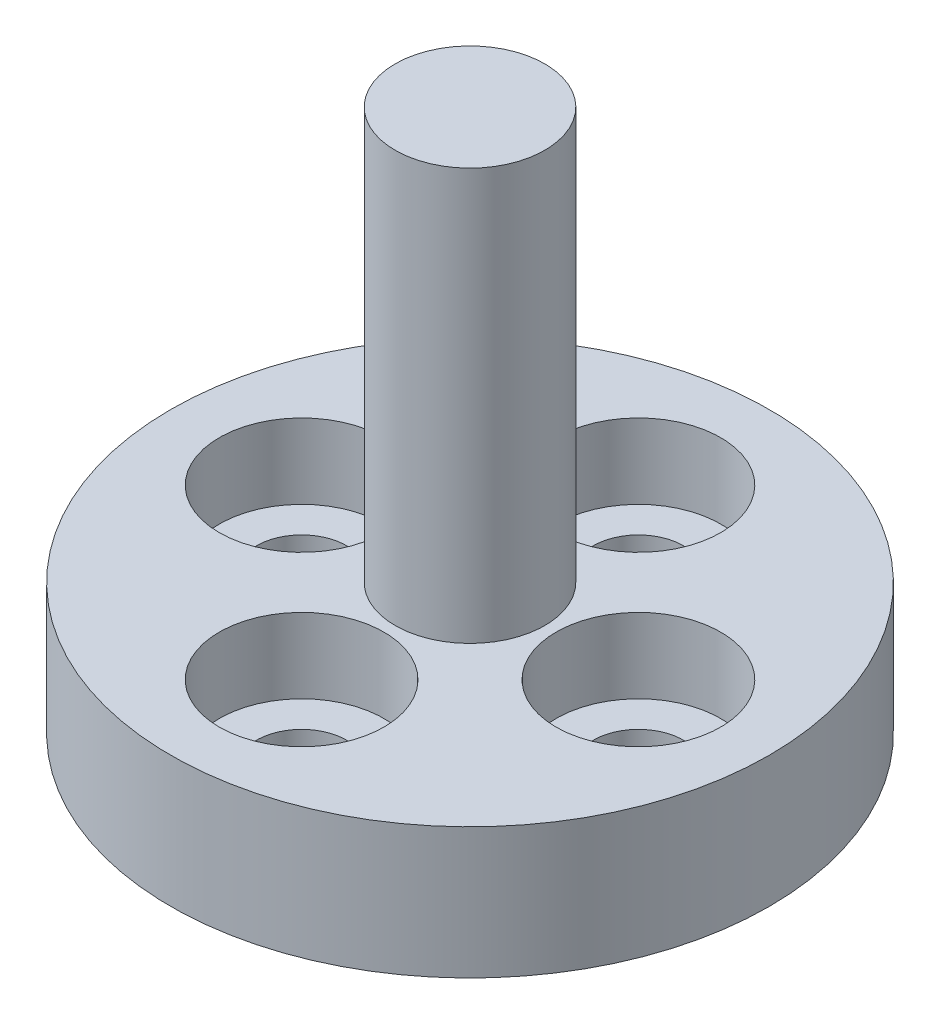
ISO-10303-21;
HEADER;
FILE_DESCRIPTION(('STEP AP214'),'2;1');
FILE_NAME('part.step','',(''),(''),'','','');
FILE_SCHEMA(('AUTOMOTIVE_DESIGN { 1 0 10303 214 1 1 1 1 }'));
ENDSEC;
DATA;
#1=APPLICATION_CONTEXT('core data for automotive mechanical design processes');
#2=APPLICATION_PROTOCOL_DEFINITION('international standard','automotive_design',2000,#1);
#3=PRODUCT_CONTEXT('',#1,'mechanical');
#4=PRODUCT('Part','Part','',(#3));
#5=PRODUCT_RELATED_PRODUCT_CATEGORY('part','',(#4));
#6=PRODUCT_DEFINITION_FORMATION('','',#4);
#7=PRODUCT_DEFINITION_CONTEXT('part definition',#1,'design');
#8=PRODUCT_DEFINITION('design','',#6,#7);
#9=PRODUCT_DEFINITION_SHAPE('','',#8);
#10=(LENGTH_UNIT() NAMED_UNIT(*) SI_UNIT(.MILLI.,.METRE.));
#11=(NAMED_UNIT(*) PLANE_ANGLE_UNIT() SI_UNIT($,.RADIAN.));
#12=(NAMED_UNIT(*) SI_UNIT($,.STERADIAN.) SOLID_ANGLE_UNIT());
#13=UNCERTAINTY_MEASURE_WITH_UNIT(LENGTH_MEASURE(1.E-05),#10,'distance_accuracy_value','');
#14=(GEOMETRIC_REPRESENTATION_CONTEXT(3) GLOBAL_UNCERTAINTY_ASSIGNED_CONTEXT((#13)) GLOBAL_UNIT_ASSIGNED_CONTEXT((#10,
#11,#12)) REPRESENTATION_CONTEXT('',''));
#15=CARTESIAN_POINT('',(0.,0.,0.));
#16=DIRECTION('',(0.,0.,1.));
#17=DIRECTION('',(1.,0.,0.));
#18=AXIS2_PLACEMENT_3D('',#15,#16,#17);
#19=CARTESIAN_POINT('',(0.,0.,0.));
#20=DIRECTION('',(0.,1.,0.));
#21=DIRECTION('',(-1.,0.,0.));
#22=AXIS2_PLACEMENT_3D('',#19,#20,#21);
#23=PLANE('',#22);
#24=CARTESIAN_POINT('',(-4.5,0.,0.));
#25=DIRECTION('',(0.,1.,0.));
#26=DIRECTION('',(0.,0.,1.));
#27=AXIS2_PLACEMENT_3D('',#24,#25,#26);
#28=CIRCLE('',#27,1.2);
#29=CARTESIAN_POINT('',(-4.5,0.,1.2));
#30=VERTEX_POINT('',#29);
#31=EDGE_CURVE('E85',#30,#30,#28,.T.);
#32=ORIENTED_EDGE('',*,*,#31,.T.);
#33=EDGE_LOOP('',(#32));
#34=FACE_BOUND('',#33,.T.);
#35=CARTESIAN_POINT('',(0.,0.,-4.5));
#36=DIRECTION('',(0.,1.,0.));
#37=DIRECTION('',(0.,0.,1.));
#38=AXIS2_PLACEMENT_3D('',#35,#36,#37);
#39=CIRCLE('',#38,1.2);
#40=CARTESIAN_POINT('',(0.,0.,-3.3));
#41=VERTEX_POINT('',#40);
#42=EDGE_CURVE('E73',#41,#41,#39,.T.);
#43=ORIENTED_EDGE('',*,*,#42,.T.);
#44=EDGE_LOOP('',(#43));
#45=FACE_BOUND('',#44,.T.);
#46=CARTESIAN_POINT('',(4.5,0.,0.));
#47=DIRECTION('',(0.,1.,0.));
#48=DIRECTION('',(0.,0.,1.));
#49=AXIS2_PLACEMENT_3D('',#46,#47,#48);
#50=CIRCLE('',#49,1.2);
#51=CARTESIAN_POINT('',(4.5,0.,1.2));
#52=VERTEX_POINT('',#51);
#53=EDGE_CURVE('E61',#52,#52,#50,.T.);
#54=ORIENTED_EDGE('',*,*,#53,.T.);
#55=EDGE_LOOP('',(#54));
#56=FACE_BOUND('',#55,.T.);
#57=CARTESIAN_POINT('',(0.,0.,4.5));
#58=DIRECTION('',(0.,1.,0.));
#59=DIRECTION('',(0.,0.,1.));
#60=AXIS2_PLACEMENT_3D('',#57,#58,#59);
#61=CIRCLE('',#60,1.2);
#62=CARTESIAN_POINT('',(0.,0.,5.7));
#63=VERTEX_POINT('',#62);
#64=EDGE_CURVE('E49',#63,#63,#61,.T.);
#65=ORIENTED_EDGE('',*,*,#64,.T.);
#66=EDGE_LOOP('',(#65));
#67=FACE_BOUND('',#66,.T.);
#68=CARTESIAN_POINT('',(0.,0.,0.));
#69=DIRECTION('',(0.,1.,0.));
#70=DIRECTION('',(-1.,0.,0.));
#71=AXIS2_PLACEMENT_3D('',#68,#69,#70);
#72=CIRCLE('',#71,8.);
#73=CARTESIAN_POINT('',(-8.,0.,0.));
#74=VERTEX_POINT('',#73);
#75=EDGE_CURVE('E10',#74,#74,#72,.T.);
#76=ORIENTED_EDGE('',*,*,#75,.F.);
#77=EDGE_LOOP('',(#76));
#78=FACE_BOUND('',#77,.T.);
#79=ADVANCED_FACE('F30',(#34,#45,#56,#67,#78),#23,.F.);
#80=CARTESIAN_POINT('',(0.,14.5,0.));
#81=DIRECTION('',(0.,1.,0.));
#82=DIRECTION('',(-1.,0.,0.));
#83=AXIS2_PLACEMENT_3D('',#80,#81,#82);
#84=CYLINDRICAL_SURFACE('',#83,8.);
#85=CARTESIAN_POINT('',(0.,3.5,0.));
#86=DIRECTION('',(0.,1.,0.));
#87=DIRECTION('',(-1.,0.,0.));
#88=AXIS2_PLACEMENT_3D('',#85,#86,#87);
#89=CIRCLE('',#88,8.);
#90=CARTESIAN_POINT('',(-8.,3.5,0.));
#91=VERTEX_POINT('',#90);
#92=EDGE_CURVE('E36',#91,#91,#89,.T.);
#93=ORIENTED_EDGE('',*,*,#92,.F.);
#94=EDGE_LOOP('',(#93));
#95=FACE_BOUND('',#94,.T.);
#96=ORIENTED_EDGE('',*,*,#75,.T.);
#97=EDGE_LOOP('',(#96));
#98=FACE_BOUND('',#97,.T.);
#99=ADVANCED_FACE('F104',(#95,#98),#84,.T.);
#100=CARTESIAN_POINT('',(8.,3.5,0.));
#101=DIRECTION('',(0.,-1.,0.));
#102=DIRECTION('',(1.,0.,0.));
#103=AXIS2_PLACEMENT_3D('',#100,#101,#102);
#104=PLANE('',#103);
#105=CARTESIAN_POINT('',(-4.5,3.5,0.));
#106=DIRECTION('',(0.,1.,0.));
#107=DIRECTION('',(0.,0.,1.));
#108=AXIS2_PLACEMENT_3D('',#105,#106,#107);
#109=CIRCLE('',#108,2.2);
#110=CARTESIAN_POINT('',(-4.5,3.5,2.2));
#111=VERTEX_POINT('',#110);
#112=EDGE_CURVE('E94',#111,#111,#109,.T.);
#113=ORIENTED_EDGE('',*,*,#112,.F.);
#114=EDGE_LOOP('',(#113));
#115=FACE_BOUND('',#114,.T.);
#116=CARTESIAN_POINT('',(0.,3.5,-4.5));
#117=DIRECTION('',(0.,1.,0.));
#118=DIRECTION('',(0.,0.,1.));
#119=AXIS2_PLACEMENT_3D('',#116,#117,#118);
#120=CIRCLE('',#119,2.2);
#121=CARTESIAN_POINT('',(0.,3.5,-2.3));
#122=VERTEX_POINT('',#121);
#123=EDGE_CURVE('E82',#122,#122,#120,.T.);
#124=ORIENTED_EDGE('',*,*,#123,.F.);
#125=EDGE_LOOP('',(#124));
#126=FACE_BOUND('',#125,.T.);
#127=CARTESIAN_POINT('',(4.5,3.5,0.));
#128=DIRECTION('',(0.,1.,0.));
#129=DIRECTION('',(0.,0.,1.));
#130=AXIS2_PLACEMENT_3D('',#127,#128,#129);
#131=CIRCLE('',#130,2.2);
#132=CARTESIAN_POINT('',(4.5,3.5,2.2));
#133=VERTEX_POINT('',#132);
#134=EDGE_CURVE('E70',#133,#133,#131,.T.);
#135=ORIENTED_EDGE('',*,*,#134,.F.);
#136=EDGE_LOOP('',(#135));
#137=FACE_BOUND('',#136,.T.);
#138=CARTESIAN_POINT('',(0.,3.5,4.5));
#139=DIRECTION('',(0.,1.,0.));
#140=DIRECTION('',(0.,0.,1.));
#141=AXIS2_PLACEMENT_3D('',#138,#139,#140);
#142=CIRCLE('',#141,2.2);
#143=CARTESIAN_POINT('',(0.,3.5,6.7));
#144=VERTEX_POINT('',#143);
#145=EDGE_CURVE('E58',#144,#144,#142,.T.);
#146=ORIENTED_EDGE('',*,*,#145,.F.);
#147=EDGE_LOOP('',(#146));
#148=FACE_BOUND('',#147,.T.);
#149=CARTESIAN_POINT('',(0.,3.5,0.));
#150=DIRECTION('',(0.,1.,0.));
#151=DIRECTION('',(-1.,0.,0.));
#152=AXIS2_PLACEMENT_3D('',#149,#150,#151);
#153=CIRCLE('',#152,2.);
#154=CARTESIAN_POINT('',(-2.,3.5,0.));
#155=VERTEX_POINT('',#154);
#156=EDGE_CURVE('E40',#155,#155,#153,.T.);
#157=ORIENTED_EDGE('',*,*,#156,.F.);
#158=EDGE_LOOP('',(#157));
#159=FACE_BOUND('',#158,.T.);
#160=ORIENTED_EDGE('',*,*,#92,.T.);
#161=EDGE_LOOP('',(#160));
#162=FACE_BOUND('',#161,.T.);
#163=ADVANCED_FACE('F100',(#115,#126,#137,#148,#159,#162),#104,.F.);
#164=CARTESIAN_POINT('',(0.,14.5,0.));
#165=DIRECTION('',(0.,1.,0.));
#166=DIRECTION('',(-1.,0.,0.));
#167=AXIS2_PLACEMENT_3D('',#164,#165,#166);
#168=CYLINDRICAL_SURFACE('',#167,2.);
#169=CARTESIAN_POINT('',(0.,14.5,0.));
#170=DIRECTION('',(0.,1.,0.));
#171=DIRECTION('',(-1.,0.,0.));
#172=AXIS2_PLACEMENT_3D('',#169,#170,#171);
#173=CIRCLE('',#172,2.);
#174=CARTESIAN_POINT('',(-2.,14.5,0.));
#175=VERTEX_POINT('',#174);
#176=EDGE_CURVE('E44',#175,#175,#173,.T.);
#177=ORIENTED_EDGE('',*,*,#176,.F.);
#178=EDGE_LOOP('',(#177));
#179=FACE_BOUND('',#178,.T.);
#180=ORIENTED_EDGE('',*,*,#156,.T.);
#181=EDGE_LOOP('',(#180));
#182=FACE_BOUND('',#181,.T.);
#183=ADVANCED_FACE('F103',(#179,#182),#168,.T.);
#184=CARTESIAN_POINT('',(2.,14.5,0.));
#185=DIRECTION('',(0.,-1.,0.));
#186=DIRECTION('',(1.,0.,0.));
#187=AXIS2_PLACEMENT_3D('',#184,#185,#186);
#188=PLANE('',#187);
#189=ORIENTED_EDGE('',*,*,#176,.T.);
#190=EDGE_LOOP('',(#189));
#191=FACE_BOUND('',#190,.T.);
#192=ADVANCED_FACE('F115',(#191),#188,.F.);
#193=CARTESIAN_POINT('',(0.,3.5,4.5));
#194=DIRECTION('',(0.,1.,0.));
#195=DIRECTION('',(0.,0.,1.));
#196=AXIS2_PLACEMENT_3D('',#193,#194,#195);
#197=CYLINDRICAL_SURFACE('',#196,1.2);
#198=ORIENTED_EDGE('',*,*,#64,.F.);
#199=EDGE_LOOP('',(#198));
#200=FACE_BOUND('',#199,.T.);
#201=CARTESIAN_POINT('',(0.,1.5,4.5));
#202=DIRECTION('',(0.,1.,0.));
#203=DIRECTION('',(0.,0.,1.));
#204=AXIS2_PLACEMENT_3D('',#201,#202,#203);
#205=CIRCLE('',#204,1.2);
#206=CARTESIAN_POINT('',(0.,1.5,5.7));
#207=VERTEX_POINT('',#206);
#208=EDGE_CURVE('E52',#207,#207,#205,.T.);
#209=ORIENTED_EDGE('',*,*,#208,.T.);
#210=EDGE_LOOP('',(#209));
#211=FACE_BOUND('',#210,.T.);
#212=ADVANCED_FACE('F121',(#200,#211),#197,.F.);
#213=CARTESIAN_POINT('',(1.2,1.5,4.5));
#214=DIRECTION('',(0.,-1.,0.));
#215=DIRECTION('',(0.,0.,-1.));
#216=AXIS2_PLACEMENT_3D('',#213,#214,#215);
#217=PLANE('',#216);
#218=ORIENTED_EDGE('',*,*,#208,.F.);
#219=EDGE_LOOP('',(#218));
#220=FACE_BOUND('',#219,.T.);
#221=CARTESIAN_POINT('',(0.,1.5,4.5));
#222=DIRECTION('',(0.,1.,0.));
#223=DIRECTION('',(0.,0.,1.));
#224=AXIS2_PLACEMENT_3D('',#221,#222,#223);
#225=CIRCLE('',#224,2.2);
#226=CARTESIAN_POINT('',(0.,1.5,6.7));
#227=VERTEX_POINT('',#226);
#228=EDGE_CURVE('E55',#227,#227,#225,.T.);
#229=ORIENTED_EDGE('',*,*,#228,.T.);
#230=EDGE_LOOP('',(#229));
#231=FACE_BOUND('',#230,.T.);
#232=ADVANCED_FACE('F142',(#220,#231),#217,.F.);
#233=CARTESIAN_POINT('',(0.,3.5,4.5));
#234=DIRECTION('',(0.,1.,0.));
#235=DIRECTION('',(0.,0.,1.));
#236=AXIS2_PLACEMENT_3D('',#233,#234,#235);
#237=CYLINDRICAL_SURFACE('',#236,2.2);
#238=ORIENTED_EDGE('',*,*,#228,.F.);
#239=EDGE_LOOP('',(#238));
#240=FACE_BOUND('',#239,.T.);
#241=ORIENTED_EDGE('',*,*,#145,.T.);
#242=EDGE_LOOP('',(#241));
#243=FACE_BOUND('',#242,.T.);
#244=ADVANCED_FACE('F148',(#240,#243),#237,.F.);
#245=CARTESIAN_POINT('',(4.5,3.5,0.));
#246=DIRECTION('',(0.,1.,0.));
#247=DIRECTION('',(0.,0.,1.));
#248=AXIS2_PLACEMENT_3D('',#245,#246,#247);
#249=CYLINDRICAL_SURFACE('',#248,1.2);
#250=ORIENTED_EDGE('',*,*,#53,.F.);
#251=EDGE_LOOP('',(#250));
#252=FACE_BOUND('',#251,.T.);
#253=CARTESIAN_POINT('',(4.5,1.5,0.));
#254=DIRECTION('',(0.,1.,0.));
#255=DIRECTION('',(0.,0.,1.));
#256=AXIS2_PLACEMENT_3D('',#253,#254,#255);
#257=CIRCLE('',#256,1.2);
#258=CARTESIAN_POINT('',(4.5,1.5,1.2));
#259=VERTEX_POINT('',#258);
#260=EDGE_CURVE('E64',#259,#259,#257,.T.);
#261=ORIENTED_EDGE('',*,*,#260,.T.);
#262=EDGE_LOOP('',(#261));
#263=FACE_BOUND('',#262,.T.);
#264=ADVANCED_FACE('F154',(#252,#263),#249,.F.);
#265=CARTESIAN_POINT('',(5.7,1.5,0.));
#266=DIRECTION('',(0.,-1.,0.));
#267=DIRECTION('',(0.,0.,-1.));
#268=AXIS2_PLACEMENT_3D('',#265,#266,#267);
#269=PLANE('',#268);
#270=ORIENTED_EDGE('',*,*,#260,.F.);
#271=EDGE_LOOP('',(#270));
#272=FACE_BOUND('',#271,.T.);
#273=CARTESIAN_POINT('',(4.5,1.5,0.));
#274=DIRECTION('',(0.,1.,0.));
#275=DIRECTION('',(0.,0.,1.));
#276=AXIS2_PLACEMENT_3D('',#273,#274,#275);
#277=CIRCLE('',#276,2.2);
#278=CARTESIAN_POINT('',(4.5,1.5,2.2));
#279=VERTEX_POINT('',#278);
#280=EDGE_CURVE('E67',#279,#279,#277,.T.);
#281=ORIENTED_EDGE('',*,*,#280,.T.);
#282=EDGE_LOOP('',(#281));
#283=FACE_BOUND('',#282,.T.);
#284=ADVANCED_FACE('F159',(#272,#283),#269,.F.);
#285=CARTESIAN_POINT('',(4.5,3.5,0.));
#286=DIRECTION('',(0.,1.,0.));
#287=DIRECTION('',(0.,0.,1.));
#288=AXIS2_PLACEMENT_3D('',#285,#286,#287);
#289=CYLINDRICAL_SURFACE('',#288,2.2);
#290=ORIENTED_EDGE('',*,*,#280,.F.);
#291=EDGE_LOOP('',(#290));
#292=FACE_BOUND('',#291,.T.);
#293=ORIENTED_EDGE('',*,*,#134,.T.);
#294=EDGE_LOOP('',(#293));
#295=FACE_BOUND('',#294,.T.);
#296=ADVANCED_FACE('F165',(#292,#295),#289,.F.);
#297=CARTESIAN_POINT('',(0.,3.5,-4.5));
#298=DIRECTION('',(0.,1.,0.));
#299=DIRECTION('',(0.,0.,1.));
#300=AXIS2_PLACEMENT_3D('',#297,#298,#299);
#301=CYLINDRICAL_SURFACE('',#300,1.2);
#302=ORIENTED_EDGE('',*,*,#42,.F.);
#303=EDGE_LOOP('',(#302));
#304=FACE_BOUND('',#303,.T.);
#305=CARTESIAN_POINT('',(0.,1.5,-4.5));
#306=DIRECTION('',(0.,1.,0.));
#307=DIRECTION('',(0.,0.,1.));
#308=AXIS2_PLACEMENT_3D('',#305,#306,#307);
#309=CIRCLE('',#308,1.2);
#310=CARTESIAN_POINT('',(0.,1.5,-3.3));
#311=VERTEX_POINT('',#310);
#312=EDGE_CURVE('E76',#311,#311,#309,.T.);
#313=ORIENTED_EDGE('',*,*,#312,.T.);
#314=EDGE_LOOP('',(#313));
#315=FACE_BOUND('',#314,.T.);
#316=ADVANCED_FACE('F169',(#304,#315),#301,.F.);
#317=CARTESIAN_POINT('',(1.2,1.5,-4.5));
#318=DIRECTION('',(0.,-1.,0.));
#319=DIRECTION('',(0.,0.,-1.));
#320=AXIS2_PLACEMENT_3D('',#317,#318,#319);
#321=PLANE('',#320);
#322=ORIENTED_EDGE('',*,*,#312,.F.);
#323=EDGE_LOOP('',(#322));
#324=FACE_BOUND('',#323,.T.);
#325=CARTESIAN_POINT('',(0.,1.5,-4.5));
#326=DIRECTION('',(0.,1.,0.));
#327=DIRECTION('',(0.,0.,1.));
#328=AXIS2_PLACEMENT_3D('',#325,#326,#327);
#329=CIRCLE('',#328,2.2);
#330=CARTESIAN_POINT('',(0.,1.5,-2.3));
#331=VERTEX_POINT('',#330);
#332=EDGE_CURVE('E79',#331,#331,#329,.T.);
#333=ORIENTED_EDGE('',*,*,#332,.T.);
#334=EDGE_LOOP('',(#333));
#335=FACE_BOUND('',#334,.T.);
#336=ADVANCED_FACE('F173',(#324,#335),#321,.F.);
#337=CARTESIAN_POINT('',(0.,3.5,-4.5));
#338=DIRECTION('',(0.,1.,0.));
#339=DIRECTION('',(0.,0.,1.));
#340=AXIS2_PLACEMENT_3D('',#337,#338,#339);
#341=CYLINDRICAL_SURFACE('',#340,2.2);
#342=ORIENTED_EDGE('',*,*,#332,.F.);
#343=EDGE_LOOP('',(#342));
#344=FACE_BOUND('',#343,.T.);
#345=ORIENTED_EDGE('',*,*,#123,.T.);
#346=EDGE_LOOP('',(#345));
#347=FACE_BOUND('',#346,.T.);
#348=ADVANCED_FACE('F177',(#344,#347),#341,.F.);
#349=CARTESIAN_POINT('',(-4.5,3.5,0.));
#350=DIRECTION('',(0.,1.,0.));
#351=DIRECTION('',(0.,0.,1.));
#352=AXIS2_PLACEMENT_3D('',#349,#350,#351);
#353=CYLINDRICAL_SURFACE('',#352,1.2);
#354=ORIENTED_EDGE('',*,*,#31,.F.);
#355=EDGE_LOOP('',(#354));
#356=FACE_BOUND('',#355,.T.);
#357=CARTESIAN_POINT('',(-4.5,1.5,0.));
#358=DIRECTION('',(0.,1.,0.));
#359=DIRECTION('',(0.,0.,1.));
#360=AXIS2_PLACEMENT_3D('',#357,#358,#359);
#361=CIRCLE('',#360,1.2);
#362=CARTESIAN_POINT('',(-4.5,1.5,1.2));
#363=VERTEX_POINT('',#362);
#364=EDGE_CURVE('E88',#363,#363,#361,.T.);
#365=ORIENTED_EDGE('',*,*,#364,.T.);
#366=EDGE_LOOP('',(#365));
#367=FACE_BOUND('',#366,.T.);
#368=ADVANCED_FACE('F181',(#356,#367),#353,.F.);
#369=CARTESIAN_POINT('',(-3.3,1.5,0.));
#370=DIRECTION('',(0.,-1.,0.));
#371=DIRECTION('',(0.,0.,-1.));
#372=AXIS2_PLACEMENT_3D('',#369,#370,#371);
#373=PLANE('',#372);
#374=ORIENTED_EDGE('',*,*,#364,.F.);
#375=EDGE_LOOP('',(#374));
#376=FACE_BOUND('',#375,.T.);
#377=CARTESIAN_POINT('',(-4.5,1.5,0.));
#378=DIRECTION('',(0.,1.,0.));
#379=DIRECTION('',(0.,0.,1.));
#380=AXIS2_PLACEMENT_3D('',#377,#378,#379);
#381=CIRCLE('',#380,2.2);
#382=CARTESIAN_POINT('',(-4.5,1.5,2.2));
#383=VERTEX_POINT('',#382);
#384=EDGE_CURVE('E91',#383,#383,#381,.T.);
#385=ORIENTED_EDGE('',*,*,#384,.T.);
#386=EDGE_LOOP('',(#385));
#387=FACE_BOUND('',#386,.T.);
#388=ADVANCED_FACE('F185',(#376,#387),#373,.F.);
#389=CARTESIAN_POINT('',(-4.5,3.5,0.));
#390=DIRECTION('',(0.,1.,0.));
#391=DIRECTION('',(0.,0.,1.));
#392=AXIS2_PLACEMENT_3D('',#389,#390,#391);
#393=CYLINDRICAL_SURFACE('',#392,2.2);
#394=ORIENTED_EDGE('',*,*,#384,.F.);
#395=EDGE_LOOP('',(#394));
#396=FACE_BOUND('',#395,.T.);
#397=ORIENTED_EDGE('',*,*,#112,.T.);
#398=EDGE_LOOP('',(#397));
#399=FACE_BOUND('',#398,.T.);
#400=ADVANCED_FACE('F98',(#396,#399),#393,.F.);
#401=CLOSED_SHELL('',(#79,#99,#163,#183,#192,#212,#232,#244,#264,#284,#296,#316,#336,#348,#368,
#388,#400));
#402=MANIFOLD_SOLID_BREP('B2',#401);
#403=ADVANCED_BREP_SHAPE_REPRESENTATION('',(#18,#402),#14);
#404=SHAPE_DEFINITION_REPRESENTATION(#9,#403);
ENDSEC;
END-ISO-10303-21;
